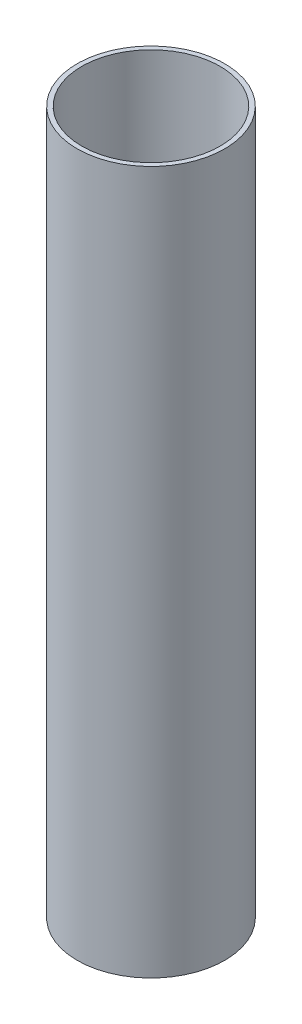
ISO-10303-21;
HEADER;
FILE_DESCRIPTION(('STEP AP214'),'2;1');
FILE_NAME('part.step','',(''),(''),'','','');
FILE_SCHEMA(('AUTOMOTIVE_DESIGN { 1 0 10303 214 1 1 1 1 }'));
ENDSEC;
DATA;
#1=APPLICATION_CONTEXT('core data for automotive mechanical design processes');
#2=APPLICATION_PROTOCOL_DEFINITION('international standard','automotive_design',2000,#1);
#3=PRODUCT_CONTEXT('',#1,'mechanical');
#4=PRODUCT('Part','Part','',(#3));
#5=PRODUCT_RELATED_PRODUCT_CATEGORY('part','',(#4));
#6=PRODUCT_DEFINITION_FORMATION('','',#4);
#7=PRODUCT_DEFINITION_CONTEXT('part definition',#1,'design');
#8=PRODUCT_DEFINITION('design','',#6,#7);
#9=PRODUCT_DEFINITION_SHAPE('','',#8);
#10=(LENGTH_UNIT() NAMED_UNIT(*) SI_UNIT(.MILLI.,.METRE.));
#11=(NAMED_UNIT(*) PLANE_ANGLE_UNIT() SI_UNIT($,.RADIAN.));
#12=(NAMED_UNIT(*) SI_UNIT($,.STERADIAN.) SOLID_ANGLE_UNIT());
#13=UNCERTAINTY_MEASURE_WITH_UNIT(LENGTH_MEASURE(1.E-05),#10,'distance_accuracy_value','');
#14=(GEOMETRIC_REPRESENTATION_CONTEXT(3) GLOBAL_UNCERTAINTY_ASSIGNED_CONTEXT((#13)) GLOBAL_UNIT_ASSIGNED_CONTEXT((#10,
#11,#12)) REPRESENTATION_CONTEXT('',''));
#15=CARTESIAN_POINT('',(0.,0.,0.));
#16=DIRECTION('',(0.,0.,1.));
#17=DIRECTION('',(1.,0.,0.));
#18=AXIS2_PLACEMENT_3D('',#15,#16,#17);
#19=CARTESIAN_POINT('',(0.,381.,0.));
#20=DIRECTION('',(0.,1.,0.));
#21=DIRECTION('',(0.,0.,1.));
#22=AXIS2_PLACEMENT_3D('',#19,#20,#21);
#23=PLANE('',#22);
#24=CARTESIAN_POINT('',(0.,381.,0.));
#25=DIRECTION('',(0.,1.,0.));
#26=DIRECTION('',(0.,0.,1.));
#27=AXIS2_PLACEMENT_3D('',#24,#25,#26);
#28=CIRCLE('',#27,40.);
#29=CARTESIAN_POINT('',(0.,381.,40.));
#30=VERTEX_POINT('',#29);
#31=EDGE_CURVE('E10',#30,#30,#28,.T.);
#32=ORIENTED_EDGE('',*,*,#31,.T.);
#33=EDGE_LOOP('',(#32));
#34=FACE_BOUND('',#33,.T.);
#35=CARTESIAN_POINT('',(0.,381.,0.));
#36=DIRECTION('',(0.,1.,0.));
#37=DIRECTION('',(0.,0.,1.));
#38=AXIS2_PLACEMENT_3D('',#35,#36,#37);
#39=CIRCLE('',#38,37.5);
#40=CARTESIAN_POINT('',(0.,381.,37.5));
#41=VERTEX_POINT('',#40);
#42=EDGE_CURVE('E43',#41,#41,#39,.T.);
#43=ORIENTED_EDGE('',*,*,#42,.F.);
#44=EDGE_LOOP('',(#43));
#45=FACE_BOUND('',#44,.T.);
#46=ADVANCED_FACE('F32',(#34,#45),#23,.T.);
#47=CARTESIAN_POINT('',(0.,0.,0.));
#48=DIRECTION('',(0.,1.,0.));
#49=DIRECTION('',(0.,0.,1.));
#50=AXIS2_PLACEMENT_3D('',#47,#48,#49);
#51=PLANE('',#50);
#52=CARTESIAN_POINT('',(0.,0.,0.));
#53=DIRECTION('',(0.,1.,0.));
#54=DIRECTION('',(0.,0.,1.));
#55=AXIS2_PLACEMENT_3D('',#52,#53,#54);
#56=CIRCLE('',#55,40.);
#57=CARTESIAN_POINT('',(0.,0.,40.));
#58=VERTEX_POINT('',#57);
#59=EDGE_CURVE('E36',#58,#58,#56,.T.);
#60=ORIENTED_EDGE('',*,*,#59,.F.);
#61=EDGE_LOOP('',(#60));
#62=FACE_BOUND('',#61,.T.);
#63=CARTESIAN_POINT('',(0.,0.,0.));
#64=DIRECTION('',(0.,1.,0.));
#65=DIRECTION('',(0.,0.,1.));
#66=AXIS2_PLACEMENT_3D('',#63,#64,#65);
#67=CIRCLE('',#66,37.5);
#68=CARTESIAN_POINT('',(0.,0.,37.5));
#69=VERTEX_POINT('',#68);
#70=EDGE_CURVE('E45',#69,#69,#67,.T.);
#71=ORIENTED_EDGE('',*,*,#70,.T.);
#72=EDGE_LOOP('',(#71));
#73=FACE_BOUND('',#72,.T.);
#74=ADVANCED_FACE('F55',(#62,#73),#51,.F.);
#75=CARTESIAN_POINT('',(0.,381.,0.));
#76=DIRECTION('',(0.,-1.,0.));
#77=DIRECTION('',(0.,0.,-1.));
#78=AXIS2_PLACEMENT_3D('',#75,#76,#77);
#79=CYLINDRICAL_SURFACE('',#78,40.);
#80=ORIENTED_EDGE('',*,*,#31,.F.);
#81=EDGE_LOOP('',(#80));
#82=FACE_BOUND('',#81,.T.);
#83=ORIENTED_EDGE('',*,*,#59,.T.);
#84=EDGE_LOOP('',(#83));
#85=FACE_BOUND('',#84,.T.);
#86=ADVANCED_FACE('F34',(#82,#85),#79,.T.);
#87=CARTESIAN_POINT('',(0.,381.,0.));
#88=DIRECTION('',(0.,-1.,0.));
#89=DIRECTION('',(0.,0.,-1.));
#90=AXIS2_PLACEMENT_3D('',#87,#88,#89);
#91=CYLINDRICAL_SURFACE('',#90,37.5);
#92=ORIENTED_EDGE('',*,*,#42,.T.);
#93=EDGE_LOOP('',(#92));
#94=FACE_BOUND('',#93,.T.);
#95=ORIENTED_EDGE('',*,*,#70,.F.);
#96=EDGE_LOOP('',(#95));
#97=FACE_BOUND('',#96,.T.);
#98=ADVANCED_FACE('F51',(#94,#97),#91,.F.);
#99=CLOSED_SHELL('',(#46,#74,#86,#98));
#100=MANIFOLD_SOLID_BREP('B2',#99);
#101=ADVANCED_BREP_SHAPE_REPRESENTATION('',(#18,#100),#14);
#102=SHAPE_DEFINITION_REPRESENTATION(#9,#101);
ENDSEC;
END-ISO-10303-21;
